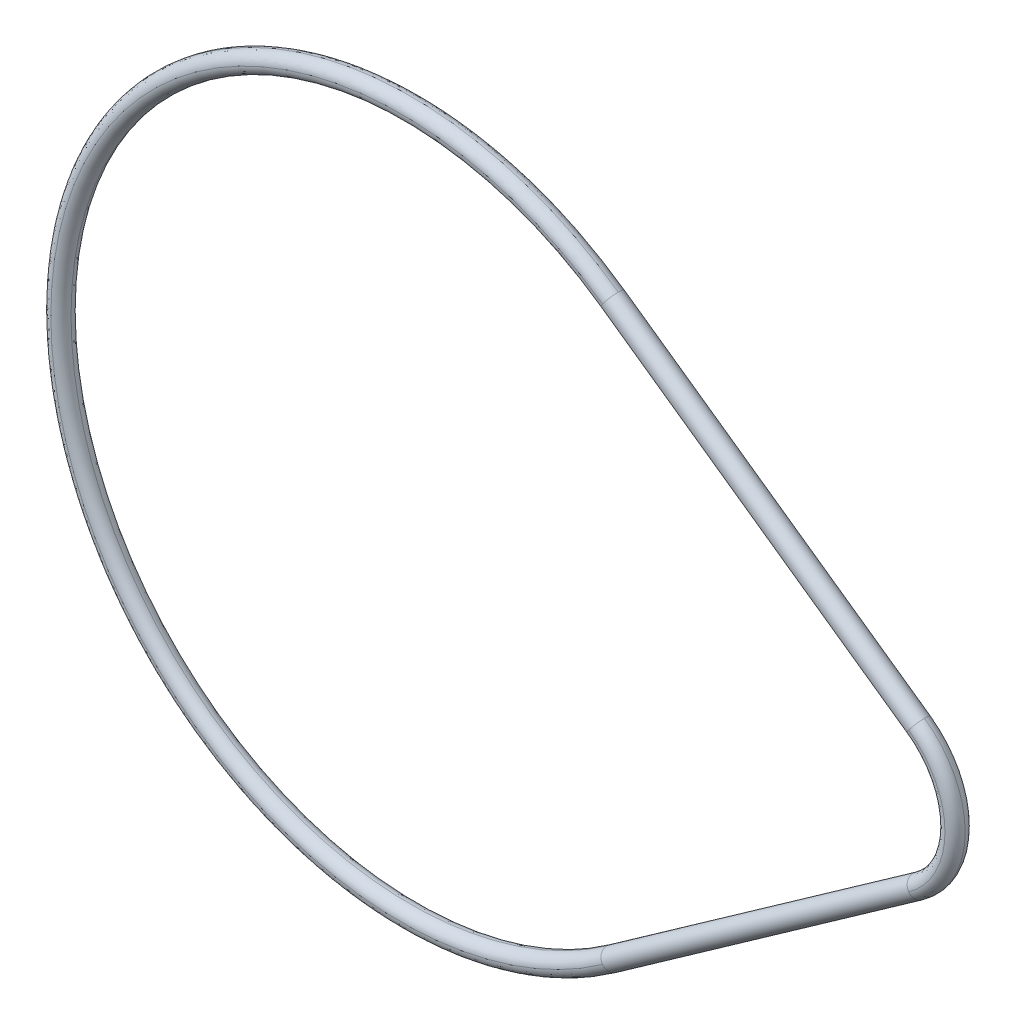
ISO-10303-21;
HEADER;
FILE_DESCRIPTION(('STEP AP214'),'2;1');
FILE_NAME('part.step','',(''),(''),'','','');
FILE_SCHEMA(('AUTOMOTIVE_DESIGN { 1 0 10303 214 1 1 1 1 }'));
ENDSEC;
DATA;
#1=APPLICATION_CONTEXT('core data for automotive mechanical design processes');
#2=APPLICATION_PROTOCOL_DEFINITION('international standard','automotive_design',2000,#1);
#3=PRODUCT_CONTEXT('',#1,'mechanical');
#4=PRODUCT('Part','Part','',(#3));
#5=PRODUCT_RELATED_PRODUCT_CATEGORY('part','',(#4));
#6=PRODUCT_DEFINITION_FORMATION('','',#4);
#7=PRODUCT_DEFINITION_CONTEXT('part definition',#1,'design');
#8=PRODUCT_DEFINITION('design','',#6,#7);
#9=PRODUCT_DEFINITION_SHAPE('','',#8);
#10=(LENGTH_UNIT() NAMED_UNIT(*) SI_UNIT(.MILLI.,.METRE.));
#11=(NAMED_UNIT(*) PLANE_ANGLE_UNIT() SI_UNIT($,.RADIAN.));
#12=(NAMED_UNIT(*) SI_UNIT($,.STERADIAN.) SOLID_ANGLE_UNIT());
#13=UNCERTAINTY_MEASURE_WITH_UNIT(LENGTH_MEASURE(1.E-05),#10,'distance_accuracy_value','');
#14=(GEOMETRIC_REPRESENTATION_CONTEXT(3) GLOBAL_UNCERTAINTY_ASSIGNED_CONTEXT((#13)) GLOBAL_UNIT_ASSIGNED_CONTEXT((#10,
#11,#12)) REPRESENTATION_CONTEXT('',''));
#15=CARTESIAN_POINT('',(0.,0.,0.));
#16=DIRECTION('',(0.,0.,1.));
#17=DIRECTION('',(1.,0.,0.));
#18=AXIS2_PLACEMENT_3D('',#15,#16,#17);
#19=CARTESIAN_POINT('',(36.0000000000003,-5.01335084557297E-13,5.08256814895025E-13));
#20=CARTESIAN_POINT('',(36.0000000000003,-5.01370953631588E-13,0.585786437627406));
#21=CARTESIAN_POINT('',(36.4142135623734,-5.01396316897254E-13,1.0000000000005));
#22=CARTESIAN_POINT('',(37.0000000000003,-5.01396316897254E-13,1.0000000000005));
#23=(BOUNDED_CURVE() B_SPLINE_CURVE(3,(#19,#20,#21,#22),.UNSPECIFIED.,.F.,
.F.) B_SPLINE_CURVE_WITH_KNOTS((4,4),(0.,1.),
.UNSPECIFIED.) CURVE() GEOMETRIC_REPRESENTATION_ITEM() RATIONAL_B_SPLINE_CURVE((1.,
0.804737854124367,0.804737854124367,1.)) REPRESENTATION_ITEM(''));
#24=CARTESIAN_POINT('',(45.5,0.,0.));
#25=DIRECTION('',(0.,0.,-1.));
#26=AXIS1_PLACEMENT('',#24,#25);
#27=SURFACE_OF_REVOLUTION('',#23,#26);
#28=CARTESIAN_POINT('',(45.5,0.,1.98768268992956E-13));
#29=DIRECTION('',(0.,0.,-1.));
#30=DIRECTION('',(-1.,0.,0.));
#31=AXIS2_PLACEMENT_3D('',#28,#29,#30);
#32=CIRCLE('',#31,9.50000000000029);
#33=CARTESIAN_POINT('',(50.9755494585222,7.76326980929764,0.));
#34=VERTEX_POINT('',#33);
#35=CARTESIAN_POINT('',(50.975549450689,-7.76326981466664,1.76786887141972E-13));
#36=VERTEX_POINT('',#35);
#37=EDGE_CURVE('E234',#34,#36,#32,.T.);
#38=ORIENTED_EDGE('',*,*,#37,.F.);
#39=CARTESIAN_POINT('',(50.399175824176,6.9460835183436,4.89369186869735E-13));
#40=DIRECTION('',(0.817186296275706,-0.576373626373721,0.));
#41=DIRECTION('',(0.576373626373721,0.817186296275706,0.));
#42=AXIS2_PLACEMENT_3D('',#39,#40,#41);
#43=CIRCLE('',#42,0.999999999999998);
#44=CARTESIAN_POINT('',(50.3991758271895,6.94608351597858,1.00000000009364));
#45=VERTEX_POINT('',#44);
#46=EDGE_CURVE('E115',#34,#45,#43,.T.);
#47=ORIENTED_EDGE('',*,*,#46,.T.);
#48=CARTESIAN_POINT('',(45.5,0.,0.999999999999801));
#49=DIRECTION('',(0.,0.,-1.));
#50=DIRECTION('',(-1.,0.,0.));
#51=AXIS2_PLACEMENT_3D('',#48,#49,#50);
#52=CIRCLE('',#51,8.49999999999936);
#53=CARTESIAN_POINT('',(50.3991758241891,-6.94608351821167,1.00000000004477));
#54=VERTEX_POINT('',#53);
#55=EDGE_CURVE('E127',#54,#45,#52,.F.);
#56=ORIENTED_EDGE('',*,*,#55,.F.);
#57=CARTESIAN_POINT('',(50.3991758241755,-6.94608351834397,4.96143911144638E-13));
#58=DIRECTION('',(0.817186296275824,0.576373626373555,0.));
#59=DIRECTION('',(-0.576373626373555,0.817186296275824,0.));
#60=AXIS2_PLACEMENT_3D('',#57,#58,#59);
#61=CIRCLE('',#60,0.999999999999997);
#62=EDGE_CURVE('E112',#54,#36,#61,.T.);
#63=ORIENTED_EDGE('',*,*,#62,.T.);
#64=EDGE_LOOP('',(#38,#47,#56,#63));
#65=FACE_BOUND('',#64,.T.);
#66=ADVANCED_FACE('F17',(#65),#27,.F.);
#67=CARTESIAN_POINT('',(20.014574175452,28.3767941383865,0.));
#68=DIRECTION('',(-0.817186296275671,0.576373626373771,0.));
#69=DIRECTION('',(-0.576373626373771,-0.817186296275671,0.));
#70=AXIS2_PLACEMENT_3D('',#67,#68,#69);
#71=CYLINDRICAL_SURFACE('',#70,1.00000000001412);
#72=CARTESIAN_POINT('',(20.0145741757998,28.3767941381412,0.));
#73=DIRECTION('',(-0.817186296275672,0.576373626373769,0.));
#74=DIRECTION('',(-0.576373626373768,-0.817186296275673,0.));
#75=AXIS2_PLACEMENT_3D('',#72,#73,#74);
#76=CIRCLE('',#75,1.00000000013568);
#77=CARTESIAN_POINT('',(20.0145741757302,28.3767941379994,0.999999999957662));
#78=VERTEX_POINT('',#77);
#79=CARTESIAN_POINT('',(19.4382005494771,27.5596078418944,0.));
#80=VERTEX_POINT('',#79);
#81=EDGE_CURVE('E89',#78,#80,#76,.F.);
#82=ORIENTED_EDGE('',*,*,#81,.T.);
#83=CARTESIAN_POINT('',(20.0145741758809,28.376794138084,0.));
#84=DIRECTION('',(0.817186296276143,-0.576373626373101,0.));
#85=DIRECTION('',(0.5763736263731,0.817186296276144,0.));
#86=AXIS2_PLACEMENT_3D('',#83,#84,#85);
#87=CIRCLE('',#86,0.999999999559293);
#88=CARTESIAN_POINT('',(20.0145741757954,28.3767941380488,-0.999999999813564));
#89=VERTEX_POINT('',#88);
#90=EDGE_CURVE('E101',#80,#89,#87,.T.);
#91=ORIENTED_EDGE('',*,*,#90,.T.);
#92=CARTESIAN_POINT('',(20.0145741758244,28.376794138176,0.));
#93=DIRECTION('',(-0.817186296275768,0.576373626373633,0.));
#94=DIRECTION('',(-0.576373626373633,-0.817186296275768,0.));
#95=AXIS2_PLACEMENT_3D('',#92,#93,#94);
#96=CIRCLE('',#95,1.);
#97=CARTESIAN_POINT('',(20.5909478021125,29.1939804342449,0.));
#98=VERTEX_POINT('',#97);
#99=EDGE_CURVE('E235',#98,#89,#96,.T.);
#100=ORIENTED_EDGE('',*,*,#99,.F.);
#101=CARTESIAN_POINT('',(20.0145741758809,28.376794138084,0.));
#102=DIRECTION('',(0.817186296276143,-0.576373626373101,0.));
#103=DIRECTION('',(0.5763736263731,0.817186296276144,0.));
#104=AXIS2_PLACEMENT_3D('',#101,#102,#103);
#105=CIRCLE('',#104,0.999999999559293);
#106=EDGE_CURVE('E104',#98,#78,#105,.T.);
#107=ORIENTED_EDGE('',*,*,#106,.T.);
#108=EDGE_LOOP('',(#82,#91,#100,#107));
#109=FACE_BOUND('',#108,.T.);
#110=CARTESIAN_POINT('',(50.3991758119884,6.9460835269171,0.));
#111=DIRECTION('',(0.817186296276143,-0.576373626373101,0.));
#112=DIRECTION('',(0.576373626373101,0.817186296276143,0.));
#113=AXIS2_PLACEMENT_3D('',#110,#111,#112);
#114=CIRCLE('',#113,1.0000000005891);
#115=CARTESIAN_POINT('',(50.3991758195628,6.94608352141073,-1.00000000026769));
#116=VERTEX_POINT('',#115);
#117=CARTESIAN_POINT('',(49.8228021947695,6.12889722405684,0.));
#118=VERTEX_POINT('',#117);
#119=EDGE_CURVE('E106',#116,#118,#114,.F.);
#120=ORIENTED_EDGE('',*,*,#119,.T.);
#121=CARTESIAN_POINT('',(50.3991758243119,6.94608351818795,0.));
#122=DIRECTION('',(-0.817186296275672,0.576373626373769,0.));
#123=DIRECTION('',(-0.576373626373767,-0.817186296275674,0.));
#124=AXIS2_PLACEMENT_3D('',#121,#122,#123);
#125=CIRCLE('',#124,0.999999999892656);
#126=EDGE_CURVE('E21',#118,#45,#125,.T.);
#127=ORIENTED_EDGE('',*,*,#126,.T.);
#128=ORIENTED_EDGE('',*,*,#46,.F.);
#129=CARTESIAN_POINT('',(50.3991758363535,6.94608350975533,1.95038923794902E-13));
#130=DIRECTION('',(0.817186295265276,-0.576373627806316,0.));
#131=DIRECTION('',(0.576373627806316,0.817186295265276,0.));
#132=AXIS2_PLACEMENT_3D('',#129,#130,#131);
#133=CIRCLE('',#132,0.999999999999996);
#134=EDGE_CURVE('E231',#116,#34,#133,.T.);
#135=ORIENTED_EDGE('',*,*,#134,.F.);
#136=EDGE_LOOP('',(#120,#127,#128,#135));
#137=FACE_BOUND('',#136,.T.);
#138=ADVANCED_FACE('F98',(#109,#137),#71,.T.);
#139=CARTESIAN_POINT('',(37.0000000000006,-5.01396316897255E-13,0.999999999999801));
#140=CARTESIAN_POINT('',(37.5857864376275,-5.01396316897255E-13,0.999999999999789));
#141=CARTESIAN_POINT('',(38.0000000000006,-5.01370953631589E-13,0.585786437626689));
#142=CARTESIAN_POINT('',(38.0000000000006,-5.01335084557297E-13,-2.13101588388073E-13));
#143=(BOUNDED_CURVE() B_SPLINE_CURVE(3,(#139,#140,#141,#142),.UNSPECIFIED.,.F.,
.F.) B_SPLINE_CURVE_WITH_KNOTS((4,4),(0.,1.),
.UNSPECIFIED.) CURVE() GEOMETRIC_REPRESENTATION_ITEM() RATIONAL_B_SPLINE_CURVE((1.,
0.804737854124367,0.804737854124367,1.)) REPRESENTATION_ITEM(''));
#144=CARTESIAN_POINT('',(45.5,0.,0.));
#145=DIRECTION('',(0.,0.,-1.));
#146=AXIS1_PLACEMENT('',#144,#145);
#147=SURFACE_OF_REVOLUTION('',#143,#146);
#148=ORIENTED_EDGE('',*,*,#55,.T.);
#149=ORIENTED_EDGE('',*,*,#126,.F.);
#150=CARTESIAN_POINT('',(45.5,0.,0.));
#151=DIRECTION('',(0.,0.,-1.));
#152=DIRECTION('',(-1.,0.,0.));
#153=AXIS2_PLACEMENT_3D('',#150,#151,#152);
#154=CIRCLE('',#153,7.5);
#155=CARTESIAN_POINT('',(49.8228022004797,-6.12889722008604,-1.06520178024048E-13));
#156=VERTEX_POINT('',#155);
#157=EDGE_CURVE('E229',#156,#118,#154,.F.);
#158=ORIENTED_EDGE('',*,*,#157,.F.);
#159=CARTESIAN_POINT('',(50.3991758241752,-6.94608351834379,-2.02695013770966E-13));
#160=DIRECTION('',(0.817186296275838,0.576373626373534,0.));
#161=DIRECTION('',(-0.576373626373534,0.817186296275838,0.));
#162=AXIS2_PLACEMENT_3D('',#159,#160,#161);
#163=CIRCLE('',#162,1.);
#164=EDGE_CURVE('E117',#156,#54,#163,.T.);
#165=ORIENTED_EDGE('',*,*,#164,.T.);
#166=EDGE_LOOP('',(#148,#149,#158,#165));
#167=FACE_BOUND('',#166,.T.);
#168=ADVANCED_FACE('F139',(#167),#147,.F.);
#169=CARTESIAN_POINT('',(36.9999999999997,-5.0127385221734E-13,-0.999999999999801));
#170=CARTESIAN_POINT('',(36.4142135623728,-5.0127385221734E-13,-0.999999999999801));
#171=CARTESIAN_POINT('',(35.9999999999997,-5.01299215483006E-13,-0.585786437626706));
#172=CARTESIAN_POINT('',(35.9999999999997,-5.01335084557297E-13,1.98768268992956E-13));
#173=(BOUNDED_CURVE() B_SPLINE_CURVE(3,(#169,#170,#171,#172),.UNSPECIFIED.,.F.,
.F.) B_SPLINE_CURVE_WITH_KNOTS((4,4),(0.,1.),
.UNSPECIFIED.) CURVE() GEOMETRIC_REPRESENTATION_ITEM() RATIONAL_B_SPLINE_CURVE((1.,
0.804737854124365,0.804737854124365,1.)) REPRESENTATION_ITEM(''));
#174=CARTESIAN_POINT('',(45.5,0.,0.));
#175=DIRECTION('',(0.,0.,-1.));
#176=AXIS1_PLACEMENT('',#174,#175);
#177=SURFACE_OF_REVOLUTION('',#173,#176);
#178=ORIENTED_EDGE('',*,*,#134,.T.);
#179=ORIENTED_EDGE('',*,*,#37,.T.);
#180=CARTESIAN_POINT('',(50.3991758241758,-6.94608351834443,2.01208086776644E-13));
#181=DIRECTION('',(0.817186296275824,0.576373626373555,0.));
#182=DIRECTION('',(-0.576373626373555,0.817186296275824,0.));
#183=AXIS2_PLACEMENT_3D('',#180,#181,#182);
#184=CIRCLE('',#183,1.);
#185=CARTESIAN_POINT('',(50.3991758271441,-6.9460835160137,-1.00000000006772));
#186=VERTEX_POINT('',#185);
#187=EDGE_CURVE('E129',#36,#186,#184,.T.);
#188=ORIENTED_EDGE('',*,*,#187,.T.);
#189=CARTESIAN_POINT('',(45.5,0.,-1.));
#190=DIRECTION('',(0.,0.,-1.));
#191=DIRECTION('',(-1.,0.,0.));
#192=AXIS2_PLACEMENT_3D('',#189,#190,#191);
#193=CIRCLE('',#192,8.49999999961749);
#194=EDGE_CURVE('E208',#116,#186,#193,.T.);
#195=ORIENTED_EDGE('',*,*,#194,.F.);
#196=EDGE_LOOP('',(#178,#179,#188,#195));
#197=FACE_BOUND('',#196,.T.);
#198=ADVANCED_FACE('F142',(#197),#177,.F.);
#199=CARTESIAN_POINT('',(38.,0.,0.));
#200=CARTESIAN_POINT('',(38.,0.,-0.585786437626905));
#201=CARTESIAN_POINT('',(37.5857864376269,0.,-1.));
#202=CARTESIAN_POINT('',(37.,0.,-1.));
#203=(BOUNDED_CURVE() B_SPLINE_CURVE(3,(#199,#200,#201,#202),.UNSPECIFIED.,.F.,
.F.) B_SPLINE_CURVE_WITH_KNOTS((4,4),(0.,1.),
.UNSPECIFIED.) CURVE() GEOMETRIC_REPRESENTATION_ITEM() RATIONAL_B_SPLINE_CURVE((1.,
0.804737854124365,0.804737854124365,1.)) REPRESENTATION_ITEM(''));
#204=CARTESIAN_POINT('',(45.5,0.,0.));
#205=DIRECTION('',(0.,0.,-1.));
#206=AXIS1_PLACEMENT('',#204,#205);
#207=SURFACE_OF_REVOLUTION('',#203,#206);
#208=ORIENTED_EDGE('',*,*,#119,.F.);
#209=ORIENTED_EDGE('',*,*,#194,.T.);
#210=CARTESIAN_POINT('',(50.3991758242692,-6.94608351821809,0.));
#211=DIRECTION('',(-0.817186296275672,-0.576373626373769,0.));
#212=DIRECTION('',(0.576373626373769,-0.817186296275673,0.));
#213=AXIS2_PLACEMENT_3D('',#210,#211,#212);
#214=CIRCLE('',#213,1.00000000061949);
#215=EDGE_CURVE('E202',#156,#186,#214,.T.);
#216=ORIENTED_EDGE('',*,*,#215,.F.);
#217=ORIENTED_EDGE('',*,*,#157,.T.);
#218=EDGE_LOOP('',(#208,#209,#216,#217));
#219=FACE_BOUND('',#218,.T.);
#220=ADVANCED_FACE('F217',(#219),#207,.F.);
#221=CARTESIAN_POINT('',(50.3991758241191,-6.94608351791601,0.));
#222=DIRECTION('',(0.817186296276149,0.576373626373093,0.));
#223=DIRECTION('',(-0.576373626373093,0.817186296276149,0.));
#224=AXIS2_PLACEMENT_3D('',#221,#222,#223);
#225=CYLINDRICAL_SURFACE('',#224,0.999999999665433);
#226=CARTESIAN_POINT('',(20.0145741757997,-28.3767941381412,0.));
#227=DIRECTION('',(0.817186296276143,0.576373626373101,0.));
#228=DIRECTION('',(-0.576373626373101,0.817186296276143,0.));
#229=AXIS2_PLACEMENT_3D('',#226,#227,#228);
#230=CIRCLE('',#229,1.00000000013568);
#231=CARTESIAN_POINT('',(20.5909478021615,-29.1939804343582,0.));
#232=VERTEX_POINT('',#231);
#233=CARTESIAN_POINT('',(20.0145741757839,-28.3767941380766,-0.999999999923741));
#234=VERTEX_POINT('',#233);
#235=EDGE_CURVE('E206',#232,#234,#230,.T.);
#236=ORIENTED_EDGE('',*,*,#235,.T.);
#237=CARTESIAN_POINT('',(20.0145741758802,-28.3767941380845,0.));
#238=DIRECTION('',(-0.817186296275672,-0.576373626373769,0.));
#239=DIRECTION('',(0.57637362637377,-0.817186296275672,0.));
#240=AXIS2_PLACEMENT_3D('',#237,#238,#239);
#241=CIRCLE('',#240,0.999999999559294);
#242=CARTESIAN_POINT('',(19.4382005495796,-27.5596078419984,0.));
#243=VERTEX_POINT('',#242);
#244=EDGE_CURVE('E36',#234,#243,#241,.F.);
#245=ORIENTED_EDGE('',*,*,#244,.T.);
#246=CARTESIAN_POINT('',(20.0145741758238,-28.3767941381765,0.));
#247=DIRECTION('',(-0.817186296275778,-0.57637362637362,0.));
#248=DIRECTION('',(0.57637362637362,-0.817186296275778,0.));
#249=AXIS2_PLACEMENT_3D('',#246,#247,#248);
#250=CIRCLE('',#249,1.);
#251=CARTESIAN_POINT('',(20.0145741757497,-28.3767941379856,0.999999999722626));
#252=VERTEX_POINT('',#251);
#253=EDGE_CURVE('E91',#252,#243,#250,.T.);
#254=ORIENTED_EDGE('',*,*,#253,.F.);
#255=CARTESIAN_POINT('',(20.0145741758802,-28.3767941380845,0.));
#256=DIRECTION('',(-0.817186296275672,-0.576373626373769,0.));
#257=DIRECTION('',(0.57637362637377,-0.817186296275672,0.));
#258=AXIS2_PLACEMENT_3D('',#255,#256,#257);
#259=CIRCLE('',#258,0.999999999559294);
#260=EDGE_CURVE('E199',#252,#232,#259,.F.);
#261=ORIENTED_EDGE('',*,*,#260,.T.);
#262=EDGE_LOOP('',(#236,#245,#254,#261));
#263=FACE_BOUND('',#262,.T.);
#264=ORIENTED_EDGE('',*,*,#215,.T.);
#265=ORIENTED_EDGE('',*,*,#187,.F.);
#266=ORIENTED_EDGE('',*,*,#62,.F.);
#267=ORIENTED_EDGE('',*,*,#164,.F.);
#268=EDGE_LOOP('',(#264,#265,#266,#267));
#269=FACE_BOUND('',#268,.T.);
#270=ADVANCED_FACE('F190',(#263,#269),#225,.T.);
#271=CARTESIAN_POINT('',(-34.725,0.,1.));
#272=CARTESIAN_POINT('',(-34.1392135623731,0.,0.999999999999992));
#273=CARTESIAN_POINT('',(-33.725,0.,0.585786437626891));
#274=CARTESIAN_POINT('',(-33.725,0.,0.));
#275=(BOUNDED_CURVE() B_SPLINE_CURVE(3,(#271,#272,#273,#274),.UNSPECIFIED.,.F.,
.F.) B_SPLINE_CURVE_WITH_KNOTS((4,4),(0.,1.),
.UNSPECIFIED.) CURVE() GEOMETRIC_REPRESENTATION_ITEM() RATIONAL_B_SPLINE_CURVE((1.,
0.804737854124365,0.804737854124365,1.)) REPRESENTATION_ITEM(''));
#276=CARTESIAN_POINT('',(0.,0.,0.));
#277=DIRECTION('',(0.,0.,-1.));
#278=AXIS1_PLACEMENT('',#276,#277);
#279=SURFACE_OF_REVOLUTION('',#275,#278);
#280=CARTESIAN_POINT('',(0.,0.,1.));
#281=DIRECTION('',(0.,0.,-1.));
#282=DIRECTION('',(-1.,0.,0.));
#283=AXIS2_PLACEMENT_3D('',#280,#281,#282);
#284=CIRCLE('',#283,34.725);
#285=EDGE_CURVE('E94',#252,#78,#284,.T.);
#286=ORIENTED_EDGE('',*,*,#285,.F.);
#287=ORIENTED_EDGE('',*,*,#253,.T.);
#288=CARTESIAN_POINT('',(0.,0.,0.));
#289=DIRECTION('',(0.,0.,-1.));
#290=DIRECTION('',(-1.,0.,0.));
#291=AXIS2_PLACEMENT_3D('',#288,#289,#290);
#292=CIRCLE('',#291,33.725);
#293=EDGE_CURVE('E85',#80,#243,#292,.F.);
#294=ORIENTED_EDGE('',*,*,#293,.F.);
#295=ORIENTED_EDGE('',*,*,#81,.F.);
#296=EDGE_LOOP('',(#286,#287,#294,#295));
#297=FACE_BOUND('',#296,.T.);
#298=ADVANCED_FACE('F88',(#297),#279,.F.);
#299=CARTESIAN_POINT('',(-35.725,0.,0.));
#300=CARTESIAN_POINT('',(-35.725,0.,0.585786437626913));
#301=CARTESIAN_POINT('',(-35.3107864376269,0.,1.));
#302=CARTESIAN_POINT('',(-34.725,0.,1.));
#303=(BOUNDED_CURVE() B_SPLINE_CURVE(3,(#299,#300,#301,#302),.UNSPECIFIED.,.F.,
.F.) B_SPLINE_CURVE_WITH_KNOTS((4,4),(0.,1.),
.UNSPECIFIED.) CURVE() GEOMETRIC_REPRESENTATION_ITEM() RATIONAL_B_SPLINE_CURVE((1.,
0.804737854124368,0.804737854124368,1.)) REPRESENTATION_ITEM(''));
#304=CARTESIAN_POINT('',(0.,0.,0.));
#305=DIRECTION('',(0.,0.,-1.));
#306=AXIS1_PLACEMENT('',#304,#305);
#307=SURFACE_OF_REVOLUTION('',#303,#306);
#308=CARTESIAN_POINT('',(0.,0.,0.));
#309=DIRECTION('',(0.,0.,-1.));
#310=DIRECTION('',(-1.,0.,0.));
#311=AXIS2_PLACEMENT_3D('',#308,#309,#310);
#312=CIRCLE('',#311,35.725);
#313=EDGE_CURVE('E27',#232,#98,#312,.T.);
#314=ORIENTED_EDGE('',*,*,#313,.F.);
#315=ORIENTED_EDGE('',*,*,#260,.F.);
#316=ORIENTED_EDGE('',*,*,#285,.T.);
#317=ORIENTED_EDGE('',*,*,#106,.F.);
#318=EDGE_LOOP('',(#314,#315,#316,#317));
#319=FACE_BOUND('',#318,.T.);
#320=ADVANCED_FACE('F158',(#319),#307,.F.);
#321=CARTESIAN_POINT('',(-33.725,0.,0.));
#322=CARTESIAN_POINT('',(-33.725,0.,-0.585786437626901));
#323=CARTESIAN_POINT('',(-34.1392135623731,0.,-0.999999999999994));
#324=CARTESIAN_POINT('',(-34.725,0.,-0.999999999999994));
#325=(BOUNDED_CURVE() B_SPLINE_CURVE(3,(#321,#322,#323,#324),.UNSPECIFIED.,.F.,
.F.) B_SPLINE_CURVE_WITH_KNOTS((4,4),(0.,1.),
.UNSPECIFIED.) CURVE() GEOMETRIC_REPRESENTATION_ITEM() RATIONAL_B_SPLINE_CURVE((1.,
0.804737854124365,0.804737854124365,1.)) REPRESENTATION_ITEM(''));
#326=CARTESIAN_POINT('',(0.,0.,0.));
#327=DIRECTION('',(0.,0.,-1.));
#328=AXIS1_PLACEMENT('',#326,#327);
#329=SURFACE_OF_REVOLUTION('',#325,#328);
#330=ORIENTED_EDGE('',*,*,#293,.T.);
#331=ORIENTED_EDGE('',*,*,#244,.F.);
#332=CARTESIAN_POINT('',(0.,0.,-1.));
#333=DIRECTION('',(0.,0.,-1.));
#334=DIRECTION('',(-1.,0.,0.));
#335=AXIS2_PLACEMENT_3D('',#332,#333,#334);
#336=CIRCLE('',#335,34.725);
#337=EDGE_CURVE('E11',#89,#234,#336,.F.);
#338=ORIENTED_EDGE('',*,*,#337,.F.);
#339=ORIENTED_EDGE('',*,*,#90,.F.);
#340=EDGE_LOOP('',(#330,#331,#338,#339));
#341=FACE_BOUND('',#340,.T.);
#342=ADVANCED_FACE('F105',(#341),#329,.F.);
#343=CARTESIAN_POINT('',(-34.725,0.,-1.));
#344=CARTESIAN_POINT('',(-35.3107864376269,0.,-1.));
#345=CARTESIAN_POINT('',(-35.725,0.,-0.585786437626905));
#346=CARTESIAN_POINT('',(-35.725,0.,0.));
#347=(BOUNDED_CURVE() B_SPLINE_CURVE(3,(#343,#344,#345,#346),.UNSPECIFIED.,.F.,
.F.) B_SPLINE_CURVE_WITH_KNOTS((4,4),(0.,1.),
.UNSPECIFIED.) CURVE() GEOMETRIC_REPRESENTATION_ITEM() RATIONAL_B_SPLINE_CURVE((1.,
0.804737854124365,0.804737854124365,1.)) REPRESENTATION_ITEM(''));
#348=CARTESIAN_POINT('',(0.,0.,0.));
#349=DIRECTION('',(0.,0.,-1.));
#350=AXIS1_PLACEMENT('',#348,#349);
#351=SURFACE_OF_REVOLUTION('',#347,#350);
#352=ORIENTED_EDGE('',*,*,#337,.T.);
#353=ORIENTED_EDGE('',*,*,#235,.F.);
#354=ORIENTED_EDGE('',*,*,#313,.T.);
#355=ORIENTED_EDGE('',*,*,#99,.T.);
#356=EDGE_LOOP('',(#352,#353,#354,#355));
#357=FACE_BOUND('',#356,.T.);
#358=ADVANCED_FACE('F151',(#357),#351,.F.);
#359=CLOSED_SHELL('',(#66,#138,#168,#198,#220,#270,#298,#320,#342,#358));
#360=MANIFOLD_SOLID_BREP('B1',#359);
#361=ADVANCED_BREP_SHAPE_REPRESENTATION('',(#18,#360),#14);
#362=SHAPE_DEFINITION_REPRESENTATION(#9,#361);
ENDSEC;
END-ISO-10303-21;
